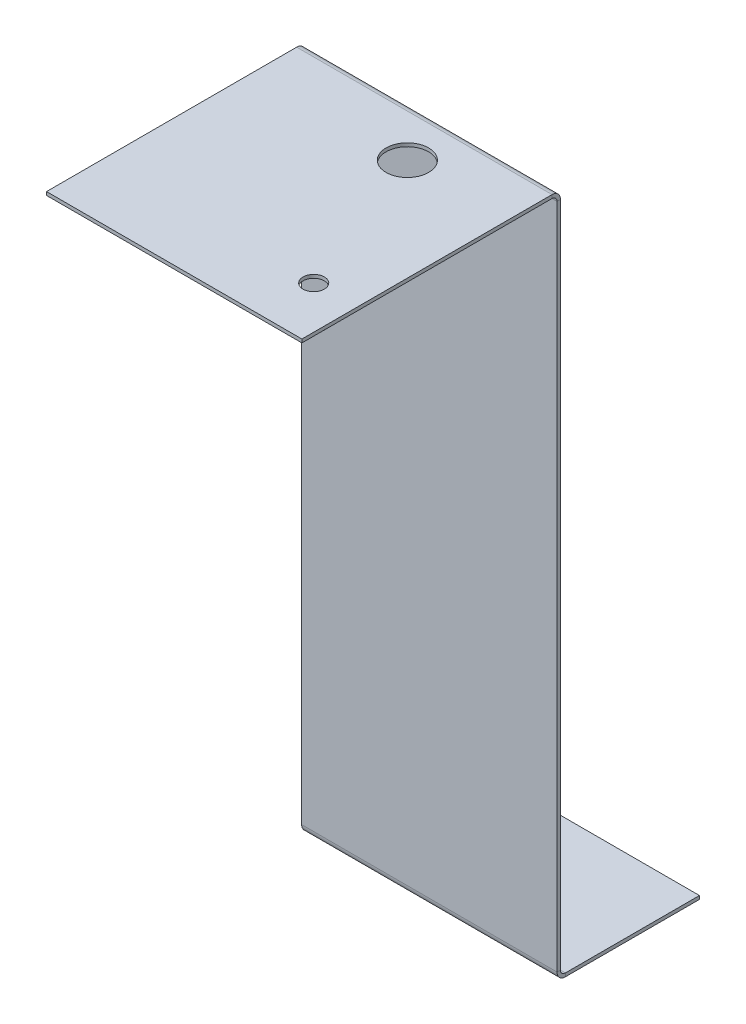
ISO-10303-21;
HEADER;
FILE_DESCRIPTION(('STEP AP214'),'2;1');
FILE_NAME('part.step','',(''),(''),'','','');
FILE_SCHEMA(('AUTOMOTIVE_DESIGN { 1 0 10303 214 1 1 1 1 }'));
ENDSEC;
DATA;
#1=APPLICATION_CONTEXT('core data for automotive mechanical design processes');
#2=APPLICATION_PROTOCOL_DEFINITION('international standard','automotive_design',2000,#1);
#3=PRODUCT_CONTEXT('',#1,'mechanical');
#4=PRODUCT('Part','Part','',(#3));
#5=PRODUCT_RELATED_PRODUCT_CATEGORY('part','',(#4));
#6=PRODUCT_DEFINITION_FORMATION('','',#4);
#7=PRODUCT_DEFINITION_CONTEXT('part definition',#1,'design');
#8=PRODUCT_DEFINITION('design','',#6,#7);
#9=PRODUCT_DEFINITION_SHAPE('','',#8);
#10=(LENGTH_UNIT() NAMED_UNIT(*) SI_UNIT(.MILLI.,.METRE.));
#11=(NAMED_UNIT(*) PLANE_ANGLE_UNIT() SI_UNIT($,.RADIAN.));
#12=(NAMED_UNIT(*) SI_UNIT($,.STERADIAN.) SOLID_ANGLE_UNIT());
#13=UNCERTAINTY_MEASURE_WITH_UNIT(LENGTH_MEASURE(1.E-05),#10,'distance_accuracy_value','');
#14=(GEOMETRIC_REPRESENTATION_CONTEXT(3) GLOBAL_UNCERTAINTY_ASSIGNED_CONTEXT((#13)) GLOBAL_UNIT_ASSIGNED_CONTEXT((#10,
#11,#12)) REPRESENTATION_CONTEXT('',''));
#15=CARTESIAN_POINT('',(0.,0.,0.));
#16=DIRECTION('',(0.,0.,1.));
#17=DIRECTION('',(1.,0.,0.));
#18=AXIS2_PLACEMENT_3D('',#15,#16,#17);
#19=CARTESIAN_POINT('',(38.1,0.,-0.508000000000008));
#20=DIRECTION('',(1.,0.,0.));
#21=DIRECTION('',(0.,1.,0.));
#22=AXIS2_PLACEMENT_3D('',#19,#20,#21);
#23=PLANE('',#22);
#24=DIRECTION('',(0.,1.,0.));
#25=VECTOR('',#24,1.);
#26=CARTESIAN_POINT('',(38.1,0.,0.));
#27=LINE('',#26,#25);
#28=CARTESIAN_POINT('',(38.1,-138.4554,0.));
#29=VERTEX_POINT('',#28);
#30=CARTESIAN_POINT('',(38.1,-38.8780154206616,0.));
#31=VERTEX_POINT('',#30);
#32=EDGE_CURVE('E259',#29,#31,#27,.T.);
#33=ORIENTED_EDGE('',*,*,#32,.F.);
#34=DIRECTION('',(0.,0.,-1.));
#35=VECTOR('',#34,1.);
#36=CARTESIAN_POINT('',(38.1,-138.4554,-0.508000000000952));
#37=LINE('',#36,#35);
#38=CARTESIAN_POINT('',(38.1,-138.4554,-0.508000000000008));
#39=VERTEX_POINT('',#38);
#40=EDGE_CURVE('E252',#29,#39,#37,.T.);
#41=ORIENTED_EDGE('',*,*,#40,.T.);
#42=DIRECTION('',(0.,1.,0.));
#43=VECTOR('',#42,1.);
#44=CARTESIAN_POINT('',(38.1,0.,-0.508000000000008));
#45=LINE('',#44,#43);
#46=CARTESIAN_POINT('',(38.1,-38.8780154206616,-0.508000000000008));
#47=VERTEX_POINT('',#46);
#48=EDGE_CURVE('E213',#39,#47,#45,.T.);
#49=ORIENTED_EDGE('',*,*,#48,.T.);
#50=DIRECTION('',(0.,0.,-1.));
#51=VECTOR('',#50,1.);
#52=CARTESIAN_POINT('',(38.1,-38.8780154206616,-0.508000000000286));
#53=LINE('',#52,#51);
#54=EDGE_CURVE('E214',#31,#47,#53,.T.);
#55=ORIENTED_EDGE('',*,*,#54,.F.);
#56=EDGE_LOOP('',(#33,#41,#49,#55));
#57=FACE_BOUND('',#56,.T.);
#58=ADVANCED_FACE('F57',(#57),#23,.T.);
#59=CARTESIAN_POINT('',(0.,0.,0.));
#60=DIRECTION('',(0.,0.,1.));
#61=DIRECTION('',(1.,0.,0.));
#62=AXIS2_PLACEMENT_3D('',#59,#60,#61);
#63=PLANE('',#62);
#64=DIRECTION('',(0.,-1.,0.));
#65=VECTOR('',#64,1.);
#66=CARTESIAN_POINT('',(0.,0.,0.));
#67=LINE('',#66,#65);
#68=CARTESIAN_POINT('',(0.,-38.8780154206616,0.));
#69=VERTEX_POINT('',#68);
#70=CARTESIAN_POINT('',(0.,-138.4554,0.));
#71=VERTEX_POINT('',#70);
#72=EDGE_CURVE('E261',#69,#71,#67,.T.);
#73=ORIENTED_EDGE('',*,*,#72,.T.);
#74=DIRECTION('',(1.,0.,0.));
#75=VECTOR('',#74,1.);
#76=CARTESIAN_POINT('',(0.,-138.4554,0.));
#77=LINE('',#76,#75);
#78=EDGE_CURVE('E66',#71,#29,#77,.T.);
#79=ORIENTED_EDGE('',*,*,#78,.T.);
#80=ORIENTED_EDGE('',*,*,#32,.T.);
#81=DIRECTION('',(1.,0.,0.));
#82=VECTOR('',#81,1.);
#83=CARTESIAN_POINT('',(0.,-38.8780154206616,0.));
#84=LINE('',#83,#82);
#85=EDGE_CURVE('E217',#69,#31,#84,.T.);
#86=ORIENTED_EDGE('',*,*,#85,.F.);
#87=EDGE_LOOP('',(#73,#79,#80,#86));
#88=FACE_BOUND('',#87,.T.);
#89=ADVANCED_FACE('F314',(#88),#63,.T.);
#90=CARTESIAN_POINT('',(0.,0.,-0.508000000000008));
#91=DIRECTION('',(-1.,0.,0.));
#92=DIRECTION('',(0.,-1.,0.));
#93=AXIS2_PLACEMENT_3D('',#90,#91,#92);
#94=PLANE('',#93);
#95=DIRECTION('',(0.,-1.,0.));
#96=VECTOR('',#95,1.);
#97=CARTESIAN_POINT('',(0.,0.,-0.508000000000008));
#98=LINE('',#97,#96);
#99=CARTESIAN_POINT('',(0.,-38.8780154206616,-0.508000000000008));
#100=VERTEX_POINT('',#99);
#101=CARTESIAN_POINT('',(0.,-138.4554,-0.508000000000008));
#102=VERTEX_POINT('',#101);
#103=EDGE_CURVE('E249',#100,#102,#98,.T.);
#104=ORIENTED_EDGE('',*,*,#103,.T.);
#105=DIRECTION('',(0.,0.,1.));
#106=VECTOR('',#105,1.);
#107=CARTESIAN_POINT('',(0.,-138.4554,-0.508000000000952));
#108=LINE('',#107,#106);
#109=EDGE_CURVE('E14',#102,#71,#108,.T.);
#110=ORIENTED_EDGE('',*,*,#109,.T.);
#111=ORIENTED_EDGE('',*,*,#72,.F.);
#112=DIRECTION('',(0.,0.,1.));
#113=VECTOR('',#112,1.);
#114=CARTESIAN_POINT('',(0.,-38.8780154206616,-0.508000000000286));
#115=LINE('',#114,#113);
#116=EDGE_CURVE('E205',#100,#69,#115,.T.);
#117=ORIENTED_EDGE('',*,*,#116,.F.);
#118=EDGE_LOOP('',(#104,#110,#111,#117));
#119=FACE_BOUND('',#118,.T.);
#120=ADVANCED_FACE('F59',(#119),#94,.T.);
#121=CARTESIAN_POINT('',(0.,-37.6334154206617,38.0585845793384));
#122=DIRECTION('',(-1.,0.,0.));
#123=DIRECTION('',(0.,0.,-1.));
#124=AXIS2_PLACEMENT_3D('',#121,#122,#123);
#125=PLANE('',#124);
#126=DIRECTION('',(0.,0.,-1.));
#127=VECTOR('',#126,1.);
#128=CARTESIAN_POINT('',(0.,-37.6334154206617,38.0585845793384));
#129=LINE('',#128,#127);
#130=CARTESIAN_POINT('',(0.,-37.6334154206617,38.0585845793384));
#131=VERTEX_POINT('',#130);
#132=CARTESIAN_POINT('',(0.,-37.6334154206616,0.736599999999976));
#133=VERTEX_POINT('',#132);
#134=EDGE_CURVE('E229',#131,#133,#129,.T.);
#135=ORIENTED_EDGE('',*,*,#134,.T.);
#136=DIRECTION('',(0.,-1.,0.));
#137=VECTOR('',#136,1.);
#138=CARTESIAN_POINT('',(0.,-37.6334154206613,0.736599999999976));
#139=LINE('',#138,#137);
#140=CARTESIAN_POINT('',(0.,-38.1414154206616,0.736599999999976));
#141=VERTEX_POINT('',#140);
#142=EDGE_CURVE('E242',#133,#141,#139,.T.);
#143=ORIENTED_EDGE('',*,*,#142,.T.);
#144=DIRECTION('',(0.,0.,-1.));
#145=VECTOR('',#144,1.);
#146=CARTESIAN_POINT('',(0.,-38.1414154206617,38.0585845793384));
#147=LINE('',#146,#145);
#148=CARTESIAN_POINT('',(0.,-38.1414154206617,38.0585845793384));
#149=VERTEX_POINT('',#148);
#150=EDGE_CURVE('E82',#149,#141,#147,.T.);
#151=ORIENTED_EDGE('',*,*,#150,.F.);
#152=DIRECTION('',(0.,-1.,0.));
#153=VECTOR('',#152,1.);
#154=CARTESIAN_POINT('',(0.,-37.6334154206617,38.0585845793384));
#155=LINE('',#154,#153);
#156=EDGE_CURVE('E231',#131,#149,#155,.T.);
#157=ORIENTED_EDGE('',*,*,#156,.F.);
#158=EDGE_LOOP('',(#135,#143,#151,#157));
#159=FACE_BOUND('',#158,.T.);
#160=ADVANCED_FACE('F287',(#159),#125,.T.);
#161=CARTESIAN_POINT('',(38.1,-37.6334154206617,38.0585845793385));
#162=DIRECTION('',(1.,0.,0.));
#163=DIRECTION('',(0.,0.,1.));
#164=AXIS2_PLACEMENT_3D('',#161,#162,#163);
#165=PLANE('',#164);
#166=DIRECTION('',(0.,0.,1.));
#167=VECTOR('',#166,1.);
#168=CARTESIAN_POINT('',(38.1,-38.1414154206617,38.0585845793385));
#169=LINE('',#168,#167);
#170=CARTESIAN_POINT('',(38.1,-38.1414154206616,0.736599999999976));
#171=VERTEX_POINT('',#170);
#172=CARTESIAN_POINT('',(38.1,-38.1414154206617,38.0585845793385));
#173=VERTEX_POINT('',#172);
#174=EDGE_CURVE('E230',#171,#173,#169,.T.);
#175=ORIENTED_EDGE('',*,*,#174,.F.);
#176=DIRECTION('',(0.,1.,0.));
#177=VECTOR('',#176,1.);
#178=CARTESIAN_POINT('',(38.1,-37.6334154206613,0.736599999999976));
#179=LINE('',#178,#177);
#180=CARTESIAN_POINT('',(38.1,-37.6334154206616,0.736599999999976));
#181=VERTEX_POINT('',#180);
#182=EDGE_CURVE('E238',#171,#181,#179,.T.);
#183=ORIENTED_EDGE('',*,*,#182,.T.);
#184=DIRECTION('',(0.,0.,1.));
#185=VECTOR('',#184,1.);
#186=CARTESIAN_POINT('',(38.1,-37.6334154206617,38.0585845793385));
#187=LINE('',#186,#185);
#188=CARTESIAN_POINT('',(38.1,-37.6334154206617,38.0585845793385));
#189=VERTEX_POINT('',#188);
#190=EDGE_CURVE('E226',#181,#189,#187,.T.);
#191=ORIENTED_EDGE('',*,*,#190,.T.);
#192=DIRECTION('',(0.,-1.,0.));
#193=VECTOR('',#192,1.);
#194=CARTESIAN_POINT('',(38.1,-37.6334154206617,38.0585845793385));
#195=LINE('',#194,#193);
#196=EDGE_CURVE('E225',#189,#173,#195,.T.);
#197=ORIENTED_EDGE('',*,*,#196,.T.);
#198=EDGE_LOOP('',(#175,#183,#191,#197));
#199=FACE_BOUND('',#198,.T.);
#200=ADVANCED_FACE('F297',(#199),#165,.T.);
#201=CARTESIAN_POINT('',(0.,-38.1414154206617,38.0585845793384));
#202=DIRECTION('',(0.,-1.,0.));
#203=DIRECTION('',(1.,0.,0.));
#204=AXIS2_PLACEMENT_3D('',#201,#202,#203);
#205=PLANE('',#204);
#206=CARTESIAN_POINT('',(22.8600000000043,-38.1414154206616,7.08660000000394));
#207=DIRECTION('',(0.,-1.,0.));
#208=DIRECTION('',(0.,0.,-1.));
#209=AXIS2_PLACEMENT_3D('',#206,#207,#208);
#210=CIRCLE('',#209,3.175);
#211=CARTESIAN_POINT('',(22.8600000000043,-38.1414154206616,3.91160000000394));
#212=VERTEX_POINT('',#211);
#213=EDGE_CURVE('E513',#212,#212,#210,.T.);
#214=ORIENTED_EDGE('',*,*,#213,.F.);
#215=EDGE_LOOP('',(#214));
#216=FACE_BOUND('',#215,.T.);
#217=CARTESIAN_POINT('',(31.749999999994,-38.1414154206617,29.946599999994));
#218=DIRECTION('',(0.,-1.,0.));
#219=DIRECTION('',(0.,0.,-1.));
#220=AXIS2_PLACEMENT_3D('',#217,#218,#219);
#221=CIRCLE('',#220,1.58749999999999);
#222=CARTESIAN_POINT('',(31.749999999994,-38.1414154206617,28.359099999994));
#223=VERTEX_POINT('',#222);
#224=EDGE_CURVE('E520',#223,#223,#221,.T.);
#225=ORIENTED_EDGE('',*,*,#224,.F.);
#226=EDGE_LOOP('',(#225));
#227=FACE_BOUND('',#226,.T.);
#228=ORIENTED_EDGE('',*,*,#150,.T.);
#229=DIRECTION('',(1.,0.,0.));
#230=VECTOR('',#229,1.);
#231=CARTESIAN_POINT('',(0.,-38.1414154206616,0.736599999999976));
#232=LINE('',#231,#230);
#233=EDGE_CURVE('E240',#141,#171,#232,.T.);
#234=ORIENTED_EDGE('',*,*,#233,.T.);
#235=ORIENTED_EDGE('',*,*,#174,.T.);
#236=DIRECTION('',(-1.,0.,0.));
#237=VECTOR('',#236,1.);
#238=CARTESIAN_POINT('',(0.,-38.1414154206617,38.0585845793384));
#239=LINE('',#238,#237);
#240=EDGE_CURVE('E227',#173,#149,#239,.T.);
#241=ORIENTED_EDGE('',*,*,#240,.T.);
#242=EDGE_LOOP('',(#228,#234,#235,#241));
#243=FACE_BOUND('',#242,.T.);
#244=ADVANCED_FACE('F295',(#216,#227,#243),#205,.T.);
#245=CARTESIAN_POINT('',(0.,-37.6334154206617,38.0585845793384));
#246=DIRECTION('',(0.,0.,1.));
#247=DIRECTION('',(0.,-1.,0.));
#248=AXIS2_PLACEMENT_3D('',#245,#246,#247);
#249=PLANE('',#248);
#250=ORIENTED_EDGE('',*,*,#240,.F.);
#251=ORIENTED_EDGE('',*,*,#196,.F.);
#252=DIRECTION('',(-1.,0.,0.));
#253=VECTOR('',#252,1.);
#254=CARTESIAN_POINT('',(0.,-37.6334154206617,38.0585845793384));
#255=LINE('',#254,#253);
#256=EDGE_CURVE('E222',#189,#131,#255,.T.);
#257=ORIENTED_EDGE('',*,*,#256,.T.);
#258=ORIENTED_EDGE('',*,*,#156,.T.);
#259=EDGE_LOOP('',(#250,#251,#257,#258));
#260=FACE_BOUND('',#259,.T.);
#261=ADVANCED_FACE('F301',(#260),#249,.T.);
#262=CARTESIAN_POINT('',(0.,-37.6334154206617,38.0585845793384));
#263=DIRECTION('',(0.,-1.,0.));
#264=DIRECTION('',(1.,0.,0.));
#265=AXIS2_PLACEMENT_3D('',#262,#263,#264);
#266=PLANE('',#265);
#267=CARTESIAN_POINT('',(22.8600000000043,-37.6334154206614,7.08660000000394));
#268=DIRECTION('',(0.,-1.,0.));
#269=DIRECTION('',(0.,0.,-1.));
#270=AXIS2_PLACEMENT_3D('',#267,#268,#269);
#271=CIRCLE('',#270,3.175);
#272=CARTESIAN_POINT('',(22.8600000000043,-37.6334154206614,3.91160000000394));
#273=VERTEX_POINT('',#272);
#274=EDGE_CURVE('E510',#273,#273,#271,.T.);
#275=ORIENTED_EDGE('',*,*,#274,.T.);
#276=EDGE_LOOP('',(#275));
#277=FACE_BOUND('',#276,.T.);
#278=CARTESIAN_POINT('',(31.749999999994,-37.6334154206615,29.946599999994));
#279=DIRECTION('',(0.,-1.,0.));
#280=DIRECTION('',(0.,0.,-1.));
#281=AXIS2_PLACEMENT_3D('',#278,#279,#280);
#282=CIRCLE('',#281,1.5875);
#283=CARTESIAN_POINT('',(31.749999999994,-37.6334154206615,28.359099999994));
#284=VERTEX_POINT('',#283);
#285=EDGE_CURVE('E186',#284,#284,#282,.T.);
#286=ORIENTED_EDGE('',*,*,#285,.T.);
#287=EDGE_LOOP('',(#286));
#288=FACE_BOUND('',#287,.T.);
#289=DIRECTION('',(1.,0.,0.));
#290=VECTOR('',#289,1.);
#291=CARTESIAN_POINT('',(0.,-37.6334154206616,0.736599999999976));
#292=LINE('',#291,#290);
#293=EDGE_CURVE('E233',#133,#181,#292,.T.);
#294=ORIENTED_EDGE('',*,*,#293,.F.);
#295=ORIENTED_EDGE('',*,*,#134,.F.);
#296=ORIENTED_EDGE('',*,*,#256,.F.);
#297=ORIENTED_EDGE('',*,*,#190,.F.);
#298=EDGE_LOOP('',(#294,#295,#296,#297));
#299=FACE_BOUND('',#298,.T.);
#300=ADVANCED_FACE('F283',(#277,#288,#299),#266,.F.);
#301=CARTESIAN_POINT('',(0.,0.,-0.508000000000008));
#302=DIRECTION('',(0.,0.,1.));
#303=DIRECTION('',(1.,0.,0.));
#304=AXIS2_PLACEMENT_3D('',#301,#302,#303);
#305=PLANE('',#304);
#306=DIRECTION('',(1.,0.,0.));
#307=VECTOR('',#306,1.);
#308=CARTESIAN_POINT('',(0.,-138.4554,-0.508000000000008));
#309=LINE('',#308,#307);
#310=EDGE_CURVE('E244',#102,#39,#309,.T.);
#311=ORIENTED_EDGE('',*,*,#310,.F.);
#312=ORIENTED_EDGE('',*,*,#103,.F.);
#313=DIRECTION('',(1.,0.,0.));
#314=VECTOR('',#313,1.);
#315=CARTESIAN_POINT('',(0.,-38.8780154206616,-0.508000000000008));
#316=LINE('',#315,#314);
#317=EDGE_CURVE('E210',#100,#47,#316,.T.);
#318=ORIENTED_EDGE('',*,*,#317,.T.);
#319=ORIENTED_EDGE('',*,*,#48,.F.);
#320=EDGE_LOOP('',(#311,#312,#318,#319));
#321=FACE_BOUND('',#320,.T.);
#322=ADVANCED_FACE('F270',(#321),#305,.F.);
#323=CARTESIAN_POINT('',(0.,-38.8780154206616,0.736599999999976));
#324=DIRECTION('',(-1.,0.,0.));
#325=DIRECTION('',(0.,-1.,0.));
#326=AXIS2_PLACEMENT_3D('',#323,#324,#325);
#327=PLANE('',#326);
#328=ORIENTED_EDGE('',*,*,#116,.T.);
#329=CARTESIAN_POINT('',(0.,-38.8780154206616,0.736599999999976));
#330=DIRECTION('',(1.,0.,0.));
#331=DIRECTION('',(0.,1.,0.));
#332=AXIS2_PLACEMENT_3D('',#329,#330,#331);
#333=CIRCLE('',#332,0.7366);
#334=EDGE_CURVE('E194',#69,#141,#333,.T.);
#335=ORIENTED_EDGE('',*,*,#334,.T.);
#336=ORIENTED_EDGE('',*,*,#142,.F.);
#337=CARTESIAN_POINT('',(0.,-38.8780154206616,0.736599999999976));
#338=DIRECTION('',(1.,0.,0.));
#339=DIRECTION('',(0.,-1.,0.));
#340=AXIS2_PLACEMENT_3D('',#337,#338,#339);
#341=CIRCLE('',#340,1.2446);
#342=EDGE_CURVE('E198',#100,#133,#341,.T.);
#343=ORIENTED_EDGE('',*,*,#342,.F.);
#344=EDGE_LOOP('',(#328,#335,#336,#343));
#345=FACE_BOUND('',#344,.T.);
#346=ADVANCED_FACE('F290',(#345),#327,.T.);
#347=CARTESIAN_POINT('',(38.1,-38.8780154206616,0.736599999999976));
#348=DIRECTION('',(1.,0.,0.));
#349=DIRECTION('',(0.,0.,-1.));
#350=AXIS2_PLACEMENT_3D('',#347,#348,#349);
#351=PLANE('',#350);
#352=ORIENTED_EDGE('',*,*,#182,.F.);
#353=CARTESIAN_POINT('',(38.1,-38.8780154206616,0.736599999999976));
#354=DIRECTION('',(1.,0.,0.));
#355=DIRECTION('',(0.,1.,0.));
#356=AXIS2_PLACEMENT_3D('',#353,#354,#355);
#357=CIRCLE('',#356,0.7366);
#358=EDGE_CURVE('E202',#171,#31,#357,.F.);
#359=ORIENTED_EDGE('',*,*,#358,.T.);
#360=ORIENTED_EDGE('',*,*,#54,.T.);
#361=CARTESIAN_POINT('',(38.1,-38.8780154206616,0.736599999999976));
#362=DIRECTION('',(-1.,0.,0.));
#363=DIRECTION('',(0.,0.,-1.));
#364=AXIS2_PLACEMENT_3D('',#361,#362,#363);
#365=CIRCLE('',#364,1.2446);
#366=EDGE_CURVE('E201',#181,#47,#365,.T.);
#367=ORIENTED_EDGE('',*,*,#366,.F.);
#368=EDGE_LOOP('',(#352,#359,#360,#367));
#369=FACE_BOUND('',#368,.T.);
#370=ADVANCED_FACE('F276',(#369),#351,.T.);
#371=CARTESIAN_POINT('',(-19.0851451548195,-38.8780154206616,0.736599999999976));
#372=DIRECTION('',(1.,0.,0.));
#373=DIRECTION('',(0.,1.,0.));
#374=AXIS2_PLACEMENT_3D('',#371,#372,#373);
#375=CYLINDRICAL_SURFACE('',#374,1.2446);
#376=ORIENTED_EDGE('',*,*,#366,.T.);
#377=ORIENTED_EDGE('',*,*,#317,.F.);
#378=ORIENTED_EDGE('',*,*,#342,.T.);
#379=ORIENTED_EDGE('',*,*,#293,.T.);
#380=EDGE_LOOP('',(#376,#377,#378,#379));
#381=FACE_BOUND('',#380,.T.);
#382=ADVANCED_FACE('F278',(#381),#375,.T.);
#383=CARTESIAN_POINT('',(-19.0851451548195,-38.8780154206616,0.736599999999976));
#384=DIRECTION('',(1.,0.,0.));
#385=DIRECTION('',(0.,1.,0.));
#386=AXIS2_PLACEMENT_3D('',#383,#384,#385);
#387=CYLINDRICAL_SURFACE('',#386,0.7366);
#388=ORIENTED_EDGE('',*,*,#358,.F.);
#389=ORIENTED_EDGE('',*,*,#233,.F.);
#390=ORIENTED_EDGE('',*,*,#334,.F.);
#391=ORIENTED_EDGE('',*,*,#85,.T.);
#392=EDGE_LOOP('',(#388,#389,#390,#391));
#393=FACE_BOUND('',#392,.T.);
#394=ADVANCED_FACE('F293',(#393),#387,.F.);
#395=CARTESIAN_POINT('',(0.,-138.4554,-1.24459999999998));
#396=DIRECTION('',(1.,0.,0.));
#397=DIRECTION('',(0.,1.,0.));
#398=AXIS2_PLACEMENT_3D('',#395,#396,#397);
#399=PLANE('',#398);
#400=DIRECTION('',(0.,-1.,0.));
#401=VECTOR('',#400,1.);
#402=CARTESIAN_POINT('',(0.,-139.191999999999,-1.24460000000004));
#403=LINE('',#402,#401);
#404=CARTESIAN_POINT('',(0.,-139.192,-1.24460000000004));
#405=VERTEX_POINT('',#404);
#406=CARTESIAN_POINT('',(0.,-139.7,-1.24460000000004));
#407=VERTEX_POINT('',#406);
#408=EDGE_CURVE('E156',#405,#407,#403,.T.);
#409=ORIENTED_EDGE('',*,*,#408,.T.);
#410=CARTESIAN_POINT('',(0.,-138.4554,-1.24459999999998));
#411=DIRECTION('',(-1.,0.,0.));
#412=DIRECTION('',(0.,-1.,0.));
#413=AXIS2_PLACEMENT_3D('',#410,#411,#412);
#414=CIRCLE('',#413,1.2446);
#415=EDGE_CURVE('E74',#407,#71,#414,.T.);
#416=ORIENTED_EDGE('',*,*,#415,.T.);
#417=ORIENTED_EDGE('',*,*,#109,.F.);
#418=CARTESIAN_POINT('',(0.,-138.4554,-1.24459999999998));
#419=DIRECTION('',(-1.,0.,0.));
#420=DIRECTION('',(0.,1.,0.));
#421=AXIS2_PLACEMENT_3D('',#418,#419,#420);
#422=CIRCLE('',#421,0.736600000000016);
#423=EDGE_CURVE('E187',#405,#102,#422,.T.);
#424=ORIENTED_EDGE('',*,*,#423,.F.);
#425=EDGE_LOOP('',(#409,#416,#417,#424));
#426=FACE_BOUND('',#425,.T.);
#427=ADVANCED_FACE('F380',(#426),#399,.F.);
#428=CARTESIAN_POINT('',(38.1,-138.4554,-1.24460000000004));
#429=DIRECTION('',(-1.,0.,0.));
#430=DIRECTION('',(0.,0.,1.));
#431=AXIS2_PLACEMENT_3D('',#428,#429,#430);
#432=PLANE('',#431);
#433=ORIENTED_EDGE('',*,*,#40,.F.);
#434=CARTESIAN_POINT('',(38.1,-138.4554,-1.24460000000004));
#435=DIRECTION('',(-1.,0.,0.));
#436=DIRECTION('',(0.,-1.,0.));
#437=AXIS2_PLACEMENT_3D('',#434,#435,#436);
#438=CIRCLE('',#437,1.2446);
#439=CARTESIAN_POINT('',(38.1,-139.7,-1.24460000000004));
#440=VERTEX_POINT('',#439);
#441=EDGE_CURVE('E191',#29,#440,#438,.F.);
#442=ORIENTED_EDGE('',*,*,#441,.T.);
#443=DIRECTION('',(0.,1.,0.));
#444=VECTOR('',#443,1.);
#445=CARTESIAN_POINT('',(38.1,-139.191999999999,-1.24460000000004));
#446=LINE('',#445,#444);
#447=CARTESIAN_POINT('',(38.1,-139.192,-1.24460000000004));
#448=VERTEX_POINT('',#447);
#449=EDGE_CURVE('E174',#440,#448,#446,.T.);
#450=ORIENTED_EDGE('',*,*,#449,.T.);
#451=CARTESIAN_POINT('',(38.1,-138.4554,-1.24460000000004));
#452=DIRECTION('',(1.,0.,0.));
#453=DIRECTION('',(0.,0.,1.));
#454=AXIS2_PLACEMENT_3D('',#451,#452,#453);
#455=CIRCLE('',#454,0.736600000000016);
#456=EDGE_CURVE('E190',#39,#448,#455,.T.);
#457=ORIENTED_EDGE('',*,*,#456,.F.);
#458=EDGE_LOOP('',(#433,#442,#450,#457));
#459=FACE_BOUND('',#458,.T.);
#460=ADVANCED_FACE('F442',(#459),#432,.F.);
#461=CARTESIAN_POINT('',(57.1851451548195,-138.4554,-1.24460000000004));
#462=DIRECTION('',(-1.,0.,0.));
#463=DIRECTION('',(0.,-1.,0.));
#464=AXIS2_PLACEMENT_3D('',#461,#462,#463);
#465=CYLINDRICAL_SURFACE('',#464,0.7366);
#466=ORIENTED_EDGE('',*,*,#456,.T.);
#467=DIRECTION('',(1.,0.,0.));
#468=VECTOR('',#467,1.);
#469=CARTESIAN_POINT('',(0.,-139.192,-1.24460000000004));
#470=LINE('',#469,#468);
#471=EDGE_CURVE('E176',#405,#448,#470,.T.);
#472=ORIENTED_EDGE('',*,*,#471,.F.);
#473=ORIENTED_EDGE('',*,*,#423,.T.);
#474=ORIENTED_EDGE('',*,*,#310,.T.);
#475=EDGE_LOOP('',(#466,#472,#473,#474));
#476=FACE_BOUND('',#475,.T.);
#477=ADVANCED_FACE('F451',(#476),#465,.F.);
#478=CARTESIAN_POINT('',(57.1851451548195,-138.4554,-1.24460000000004));
#479=DIRECTION('',(-1.,0.,0.));
#480=DIRECTION('',(0.,-1.,0.));
#481=AXIS2_PLACEMENT_3D('',#478,#479,#480);
#482=CYLINDRICAL_SURFACE('',#481,1.2446);
#483=ORIENTED_EDGE('',*,*,#441,.F.);
#484=ORIENTED_EDGE('',*,*,#78,.F.);
#485=ORIENTED_EDGE('',*,*,#415,.F.);
#486=DIRECTION('',(1.,0.,0.));
#487=VECTOR('',#486,1.);
#488=CARTESIAN_POINT('',(0.,-139.7,-1.24460000000004));
#489=LINE('',#488,#487);
#490=EDGE_CURVE('E179',#407,#440,#489,.T.);
#491=ORIENTED_EDGE('',*,*,#490,.T.);
#492=EDGE_LOOP('',(#483,#484,#485,#491));
#493=FACE_BOUND('',#492,.T.);
#494=ADVANCED_FACE('F408',(#493),#482,.T.);
#495=CARTESIAN_POINT('',(0.,-139.192,-21.253169158677));
#496=DIRECTION('',(0.,0.,-1.));
#497=DIRECTION('',(0.,1.,0.));
#498=AXIS2_PLACEMENT_3D('',#495,#496,#497);
#499=PLANE('',#498);
#500=DIRECTION('',(1.,0.,0.));
#501=VECTOR('',#500,1.);
#502=CARTESIAN_POINT('',(0.,-139.7,-21.253169158677));
#503=LINE('',#502,#501);
#504=CARTESIAN_POINT('',(0.,-139.7,-21.253169158677));
#505=VERTEX_POINT('',#504);
#506=CARTESIAN_POINT('',(38.1,-139.7,-21.253169158677));
#507=VERTEX_POINT('',#506);
#508=EDGE_CURVE('E168',#505,#507,#503,.T.);
#509=ORIENTED_EDGE('',*,*,#508,.F.);
#510=DIRECTION('',(0.,-1.,0.));
#511=VECTOR('',#510,1.);
#512=CARTESIAN_POINT('',(0.,-139.192,-21.253169158677));
#513=LINE('',#512,#511);
#514=CARTESIAN_POINT('',(0.,-139.192,-21.253169158677));
#515=VERTEX_POINT('',#514);
#516=EDGE_CURVE('E154',#515,#505,#513,.T.);
#517=ORIENTED_EDGE('',*,*,#516,.F.);
#518=DIRECTION('',(1.,0.,0.));
#519=VECTOR('',#518,1.);
#520=CARTESIAN_POINT('',(0.,-139.192,-21.253169158677));
#521=LINE('',#520,#519);
#522=CARTESIAN_POINT('',(38.1,-139.192,-21.253169158677));
#523=VERTEX_POINT('',#522);
#524=EDGE_CURVE('E166',#515,#523,#521,.T.);
#525=ORIENTED_EDGE('',*,*,#524,.T.);
#526=DIRECTION('',(0.,-1.,0.));
#527=VECTOR('',#526,1.);
#528=CARTESIAN_POINT('',(38.1,-139.192,-21.253169158677));
#529=LINE('',#528,#527);
#530=EDGE_CURVE('E173',#523,#507,#529,.T.);
#531=ORIENTED_EDGE('',*,*,#530,.T.);
#532=EDGE_LOOP('',(#509,#517,#525,#531));
#533=FACE_BOUND('',#532,.T.);
#534=ADVANCED_FACE('F165',(#533),#499,.T.);
#535=CARTESIAN_POINT('',(1.11022302462516E-13,-139.192000000001,138.766830841323));
#536=DIRECTION('',(0.,-1.,0.));
#537=DIRECTION('',(1.,0.,0.));
#538=AXIS2_PLACEMENT_3D('',#535,#536,#537);
#539=PLANE('',#538);
#540=CARTESIAN_POINT('',(19.05,-139.192,-11.2488845793384));
#541=DIRECTION('',(0.,-1.,0.));
#542=DIRECTION('',(0.,0.,-1.));
#543=AXIS2_PLACEMENT_3D('',#540,#541,#542);
#544=CIRCLE('',#543,3.17499999999999);
#545=CARTESIAN_POINT('',(19.05,-139.192,-14.4238845793384));
#546=VERTEX_POINT('',#545);
#547=EDGE_CURVE('E61',#546,#546,#544,.T.);
#548=ORIENTED_EDGE('',*,*,#547,.T.);
#549=EDGE_LOOP('',(#548));
#550=FACE_BOUND('',#549,.T.);
#551=DIRECTION('',(0.,0.,-1.));
#552=VECTOR('',#551,1.);
#553=CARTESIAN_POINT('',(1.11022302462516E-13,-139.192000000001,138.766830841323));
#554=LINE('',#553,#552);
#555=EDGE_CURVE('E151',#405,#515,#554,.T.);
#556=ORIENTED_EDGE('',*,*,#555,.F.);
#557=ORIENTED_EDGE('',*,*,#471,.T.);
#558=DIRECTION('',(0.,0.,1.));
#559=VECTOR('',#558,1.);
#560=CARTESIAN_POINT('',(38.1000000000001,-139.192000000001,138.766830841323));
#561=LINE('',#560,#559);
#562=EDGE_CURVE('E172',#523,#448,#561,.T.);
#563=ORIENTED_EDGE('',*,*,#562,.F.);
#564=ORIENTED_EDGE('',*,*,#524,.F.);
#565=EDGE_LOOP('',(#556,#557,#563,#564));
#566=FACE_BOUND('',#565,.T.);
#567=ADVANCED_FACE('F171',(#550,#566),#539,.F.);
#568=CARTESIAN_POINT('',(38.1000000000001,-139.192000000001,138.766830841323));
#569=DIRECTION('',(1.,0.,0.));
#570=DIRECTION('',(0.,0.,1.));
#571=AXIS2_PLACEMENT_3D('',#568,#569,#570);
#572=PLANE('',#571);
#573=ORIENTED_EDGE('',*,*,#449,.F.);
#574=DIRECTION('',(0.,0.,1.));
#575=VECTOR('',#574,1.);
#576=CARTESIAN_POINT('',(38.1000000000001,-139.700000000001,138.766830841323));
#577=LINE('',#576,#575);
#578=EDGE_CURVE('E161',#507,#440,#577,.T.);
#579=ORIENTED_EDGE('',*,*,#578,.F.);
#580=ORIENTED_EDGE('',*,*,#530,.F.);
#581=ORIENTED_EDGE('',*,*,#562,.T.);
#582=EDGE_LOOP('',(#573,#579,#580,#581));
#583=FACE_BOUND('',#582,.T.);
#584=ADVANCED_FACE('F416',(#583),#572,.T.);
#585=CARTESIAN_POINT('',(1.11022302462516E-13,-139.700000000001,138.766830841323));
#586=DIRECTION('',(0.,-1.,0.));
#587=DIRECTION('',(1.,0.,0.));
#588=AXIS2_PLACEMENT_3D('',#585,#586,#587);
#589=PLANE('',#588);
#590=CARTESIAN_POINT('',(19.05,-139.7,-11.2488845793384));
#591=DIRECTION('',(0.,-1.,0.));
#592=DIRECTION('',(0.,0.,-1.));
#593=AXIS2_PLACEMENT_3D('',#590,#591,#592);
#594=CIRCLE('',#593,3.175);
#595=CARTESIAN_POINT('',(19.05,-139.7,-14.4238845793384));
#596=VERTEX_POINT('',#595);
#597=EDGE_CURVE('E515',#596,#596,#594,.T.);
#598=ORIENTED_EDGE('',*,*,#597,.F.);
#599=EDGE_LOOP('',(#598));
#600=FACE_BOUND('',#599,.T.);
#601=ORIENTED_EDGE('',*,*,#490,.F.);
#602=DIRECTION('',(0.,0.,-1.));
#603=VECTOR('',#602,1.);
#604=CARTESIAN_POINT('',(1.11022302462516E-13,-139.700000000001,138.766830841323));
#605=LINE('',#604,#603);
#606=EDGE_CURVE('E527',#407,#505,#605,.T.);
#607=ORIENTED_EDGE('',*,*,#606,.T.);
#608=ORIENTED_EDGE('',*,*,#508,.T.);
#609=ORIENTED_EDGE('',*,*,#578,.T.);
#610=EDGE_LOOP('',(#601,#607,#608,#609));
#611=FACE_BOUND('',#610,.T.);
#612=ADVANCED_FACE('F422',(#600,#611),#589,.T.);
#613=CARTESIAN_POINT('',(1.11022302462516E-13,-139.192000000001,138.766830841323));
#614=DIRECTION('',(-1.,0.,0.));
#615=DIRECTION('',(0.,0.,-1.));
#616=AXIS2_PLACEMENT_3D('',#613,#614,#615);
#617=PLANE('',#616);
#618=ORIENTED_EDGE('',*,*,#408,.F.);
#619=ORIENTED_EDGE('',*,*,#555,.T.);
#620=ORIENTED_EDGE('',*,*,#516,.T.);
#621=ORIENTED_EDGE('',*,*,#606,.F.);
#622=EDGE_LOOP('',(#618,#619,#620,#621));
#623=FACE_BOUND('',#622,.T.);
#624=ADVANCED_FACE('F153',(#623),#617,.T.);
#625=CARTESIAN_POINT('',(31.749999999994,-38.1414154206617,29.946599999994));
#626=DIRECTION('',(0.,-1.,0.));
#627=DIRECTION('',(0.,0.,-1.));
#628=AXIS2_PLACEMENT_3D('',#625,#626,#627);
#629=CYLINDRICAL_SURFACE('',#628,1.5875);
#630=ORIENTED_EDGE('',*,*,#285,.F.);
#631=EDGE_LOOP('',(#630));
#632=FACE_BOUND('',#631,.T.);
#633=ORIENTED_EDGE('',*,*,#224,.T.);
#634=EDGE_LOOP('',(#633));
#635=FACE_BOUND('',#634,.T.);
#636=ADVANCED_FACE('F434',(#632,#635),#629,.F.);
#637=CARTESIAN_POINT('',(19.05,-139.7,-11.2488845793384));
#638=DIRECTION('',(0.,-1.,0.));
#639=DIRECTION('',(0.,0.,-1.));
#640=AXIS2_PLACEMENT_3D('',#637,#638,#639);
#641=CYLINDRICAL_SURFACE('',#640,3.17499999999999);
#642=ORIENTED_EDGE('',*,*,#597,.T.);
#643=EDGE_LOOP('',(#642));
#644=FACE_BOUND('',#643,.T.);
#645=ORIENTED_EDGE('',*,*,#547,.F.);
#646=EDGE_LOOP('',(#645));
#647=FACE_BOUND('',#646,.T.);
#648=ADVANCED_FACE('F489',(#644,#647),#641,.F.);
#649=CARTESIAN_POINT('',(22.8600000000043,-38.1414154206616,7.08660000000394));
#650=DIRECTION('',(0.,-1.,0.));
#651=DIRECTION('',(0.,0.,-1.));
#652=AXIS2_PLACEMENT_3D('',#649,#650,#651);
#653=CYLINDRICAL_SURFACE('',#652,3.175);
#654=ORIENTED_EDGE('',*,*,#274,.F.);
#655=EDGE_LOOP('',(#654));
#656=FACE_BOUND('',#655,.T.);
#657=ORIENTED_EDGE('',*,*,#213,.T.);
#658=EDGE_LOOP('',(#657));
#659=FACE_BOUND('',#658,.T.);
#660=ADVANCED_FACE('F497',(#656,#659),#653,.F.);
#661=CLOSED_SHELL('',(#58,#89,#120,#160,#200,#244,#261,#300,#322,#346,#370,#382,#394,#427,#460,
#477,#494,#534,#567,#584,#612,#624,#636,#648,#660));
#662=MANIFOLD_SOLID_BREP('B2',#661);
#663=ADVANCED_BREP_SHAPE_REPRESENTATION('',(#18,#662),#14);
#664=SHAPE_DEFINITION_REPRESENTATION(#9,#663);
ENDSEC;
END-ISO-10303-21;
